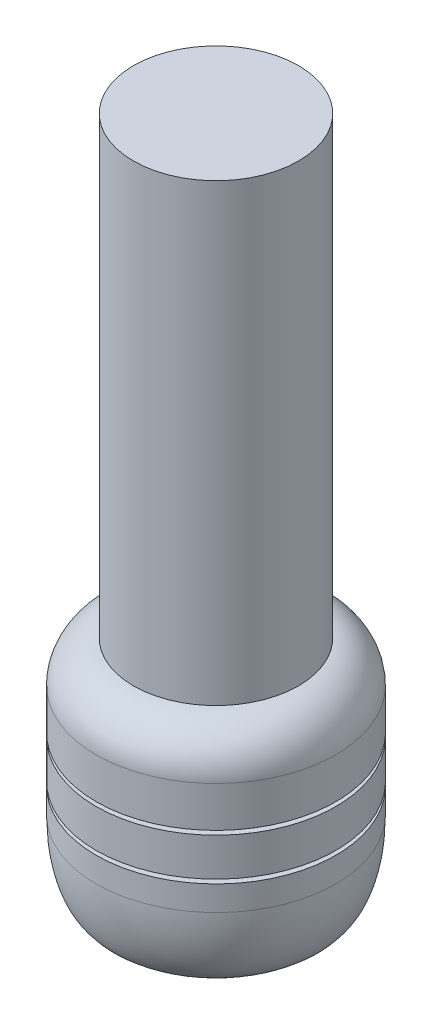
ISO-10303-21;
HEADER;
FILE_DESCRIPTION(('STEP AP214'),'2;1');
FILE_NAME('part.step','',(''),(''),'','','');
FILE_SCHEMA(('AUTOMOTIVE_DESIGN { 1 0 10303 214 1 1 1 1 }'));
ENDSEC;
DATA;
#1=APPLICATION_CONTEXT('core data for automotive mechanical design processes');
#2=APPLICATION_PROTOCOL_DEFINITION('international standard','automotive_design',2000,#1);
#3=PRODUCT_CONTEXT('',#1,'mechanical');
#4=PRODUCT('Part','Part','',(#3));
#5=PRODUCT_RELATED_PRODUCT_CATEGORY('part','',(#4));
#6=PRODUCT_DEFINITION_FORMATION('','',#4);
#7=PRODUCT_DEFINITION_CONTEXT('part definition',#1,'design');
#8=PRODUCT_DEFINITION('design','',#6,#7);
#9=PRODUCT_DEFINITION_SHAPE('','',#8);
#10=(LENGTH_UNIT() NAMED_UNIT(*) SI_UNIT(.MILLI.,.METRE.));
#11=(NAMED_UNIT(*) PLANE_ANGLE_UNIT() SI_UNIT($,.RADIAN.));
#12=(NAMED_UNIT(*) SI_UNIT($,.STERADIAN.) SOLID_ANGLE_UNIT());
#13=UNCERTAINTY_MEASURE_WITH_UNIT(LENGTH_MEASURE(1.E-05),#10,'distance_accuracy_value','');
#14=(GEOMETRIC_REPRESENTATION_CONTEXT(3) GLOBAL_UNCERTAINTY_ASSIGNED_CONTEXT((#13)) GLOBAL_UNIT_ASSIGNED_CONTEXT((#10,
#11,#12)) REPRESENTATION_CONTEXT('',''));
#15=CARTESIAN_POINT('',(0.,0.,0.));
#16=DIRECTION('',(0.,0.,1.));
#17=DIRECTION('',(1.,0.,0.));
#18=AXIS2_PLACEMENT_3D('',#15,#16,#17);
#19=CARTESIAN_POINT('',(0.,-55.,0.));
#20=DIRECTION('',(0.,1.,0.));
#21=DIRECTION('',(0.,0.,1.));
#22=AXIS2_PLACEMENT_3D('',#19,#20,#21);
#23=CYLINDRICAL_SURFACE('',#22,29.);
#24=CARTESIAN_POINT('',(0.,-30.,0.));
#25=DIRECTION('',(0.,1.,0.));
#26=DIRECTION('',(0.,0.,1.));
#27=AXIS2_PLACEMENT_3D('',#24,#25,#26);
#28=CIRCLE('',#27,29.);
#29=CARTESIAN_POINT('',(0.,-30.,29.));
#30=VERTEX_POINT('',#29);
#31=EDGE_CURVE('E142',#30,#30,#28,.T.);
#32=ORIENTED_EDGE('',*,*,#31,.T.);
#33=EDGE_LOOP('',(#32));
#34=FACE_BOUND('',#33,.T.);
#35=CARTESIAN_POINT('',(0.,-20.7835963252645,0.));
#36=DIRECTION('',(0.,1.,0.));
#37=DIRECTION('',(0.,0.,1.));
#38=AXIS2_PLACEMENT_3D('',#35,#36,#37);
#39=CIRCLE('',#38,29.);
#40=CARTESIAN_POINT('',(0.,-20.7835963252645,29.));
#41=VERTEX_POINT('',#40);
#42=EDGE_CURVE('E137',#41,#41,#39,.T.);
#43=ORIENTED_EDGE('',*,*,#42,.F.);
#44=EDGE_LOOP('',(#43));
#45=FACE_BOUND('',#44,.T.);
#46=ADVANCED_FACE('F44',(#34,#45),#23,.T.);
#47=CARTESIAN_POINT('',(0.,-20.7835963252645,0.));
#48=DIRECTION('',(0.,1.,0.));
#49=DIRECTION('',(0.,0.,1.));
#50=AXIS2_PLACEMENT_3D('',#47,#48,#49);
#51=PLANE('',#50);
#52=CARTESIAN_POINT('',(0.,-20.7835963252645,0.));
#53=DIRECTION('',(0.,1.,0.));
#54=DIRECTION('',(0.,0.,1.));
#55=AXIS2_PLACEMENT_3D('',#52,#53,#54);
#56=CIRCLE('',#55,26.5);
#57=CARTESIAN_POINT('',(0.,-20.7835963252645,26.5));
#58=VERTEX_POINT('',#57);
#59=EDGE_CURVE('E138',#58,#58,#56,.T.);
#60=ORIENTED_EDGE('',*,*,#59,.F.);
#61=EDGE_LOOP('',(#60));
#62=FACE_BOUND('',#61,.T.);
#63=ORIENTED_EDGE('',*,*,#42,.T.);
#64=EDGE_LOOP('',(#63));
#65=FACE_BOUND('',#64,.T.);
#66=ADVANCED_FACE('F186',(#62,#65),#51,.T.);
#67=CARTESIAN_POINT('',(0.,-19.7835963252645,0.));
#68=DIRECTION('',(0.,1.,0.));
#69=DIRECTION('',(0.,0.,1.));
#70=AXIS2_PLACEMENT_3D('',#67,#68,#69);
#71=PLANE('',#70);
#72=CARTESIAN_POINT('',(0.,-19.7835963252645,0.));
#73=DIRECTION('',(0.,1.,0.));
#74=DIRECTION('',(0.,0.,1.));
#75=AXIS2_PLACEMENT_3D('',#72,#73,#74);
#76=CIRCLE('',#75,26.5);
#77=CARTESIAN_POINT('',(0.,-19.7835963252645,26.5));
#78=VERTEX_POINT('',#77);
#79=EDGE_CURVE('E151',#78,#78,#76,.T.);
#80=ORIENTED_EDGE('',*,*,#79,.T.);
#81=EDGE_LOOP('',(#80));
#82=FACE_BOUND('',#81,.T.);
#83=CARTESIAN_POINT('',(0.,-19.7835963252645,0.));
#84=DIRECTION('',(0.,1.,0.));
#85=DIRECTION('',(0.,0.,1.));
#86=AXIS2_PLACEMENT_3D('',#83,#84,#85);
#87=CIRCLE('',#86,29.);
#88=CARTESIAN_POINT('',(0.,-19.7835963252645,29.));
#89=VERTEX_POINT('',#88);
#90=EDGE_CURVE('E128',#89,#89,#87,.T.);
#91=ORIENTED_EDGE('',*,*,#90,.F.);
#92=EDGE_LOOP('',(#91));
#93=FACE_BOUND('',#92,.T.);
#94=ADVANCED_FACE('F190',(#82,#93),#71,.F.);
#95=CARTESIAN_POINT('',(0.,-20.7835963252645,0.));
#96=DIRECTION('',(0.,1.,0.));
#97=DIRECTION('',(0.,0.,1.));
#98=AXIS2_PLACEMENT_3D('',#95,#96,#97);
#99=CYLINDRICAL_SURFACE('',#98,26.5);
#100=ORIENTED_EDGE('',*,*,#59,.T.);
#101=EDGE_LOOP('',(#100));
#102=FACE_BOUND('',#101,.T.);
#103=ORIENTED_EDGE('',*,*,#79,.F.);
#104=EDGE_LOOP('',(#103));
#105=FACE_BOUND('',#104,.T.);
#106=ADVANCED_FACE('F212',(#102,#105),#99,.T.);
#107=CARTESIAN_POINT('',(0.,110.,0.));
#108=DIRECTION('',(0.,1.,0.));
#109=DIRECTION('',(0.,0.,1.));
#110=AXIS2_PLACEMENT_3D('',#107,#108,#109);
#111=PLANE('',#110);
#112=CARTESIAN_POINT('',(0.,110.,0.));
#113=DIRECTION('',(0.,1.,0.));
#114=DIRECTION('',(0.,0.,1.));
#115=AXIS2_PLACEMENT_3D('',#112,#113,#114);
#116=CIRCLE('',#115,19.985);
#117=CARTESIAN_POINT('',(0.,110.,19.985));
#118=VERTEX_POINT('',#117);
#119=EDGE_CURVE('E69',#118,#118,#116,.T.);
#120=ORIENTED_EDGE('',*,*,#119,.T.);
#121=EDGE_LOOP('',(#120));
#122=FACE_BOUND('',#121,.T.);
#123=ADVANCED_FACE('F103',(#122),#111,.T.);
#124=CARTESIAN_POINT('',(0.,110.,0.));
#125=DIRECTION('',(0.,-1.,0.));
#126=DIRECTION('',(0.,0.,-1.));
#127=AXIS2_PLACEMENT_3D('',#124,#125,#126);
#128=CYLINDRICAL_SURFACE('',#127,19.985);
#129=ORIENTED_EDGE('',*,*,#119,.F.);
#130=EDGE_LOOP('',(#129));
#131=FACE_BOUND('',#130,.T.);
#132=CARTESIAN_POINT('',(0.,0.,0.));
#133=DIRECTION('',(0.,1.,0.));
#134=DIRECTION('',(0.,0.,1.));
#135=AXIS2_PLACEMENT_3D('',#132,#133,#134);
#136=CIRCLE('',#135,19.985);
#137=CARTESIAN_POINT('',(0.,0.,19.985));
#138=VERTEX_POINT('',#137);
#139=EDGE_CURVE('E75',#138,#138,#136,.T.);
#140=ORIENTED_EDGE('',*,*,#139,.T.);
#141=EDGE_LOOP('',(#140));
#142=FACE_BOUND('',#141,.T.);
#143=ADVANCED_FACE('F237',(#131,#142),#128,.T.);
#144=CARTESIAN_POINT('',(0.,-9.95137050862845,0.));
#145=DIRECTION('',(0.,1.,0.));
#146=DIRECTION('',(0.,0.,1.));
#147=AXIS2_PLACEMENT_3D('',#144,#145,#146);
#148=TOROIDAL_SURFACE('',#147,19.,10.);
#149=ORIENTED_EDGE('',*,*,#139,.F.);
#150=EDGE_LOOP('',(#149));
#151=FACE_BOUND('',#150,.T.);
#152=CARTESIAN_POINT('',(0.,-9.95137050862845,0.));
#153=DIRECTION('',(0.,1.,0.));
#154=DIRECTION('',(0.,0.,1.));
#155=AXIS2_PLACEMENT_3D('',#152,#153,#154);
#156=CIRCLE('',#155,29.);
#157=CARTESIAN_POINT('',(0.,-9.95137050862845,29.));
#158=VERTEX_POINT('',#157);
#159=EDGE_CURVE('E63',#158,#158,#156,.F.);
#160=ORIENTED_EDGE('',*,*,#159,.F.);
#161=EDGE_LOOP('',(#160));
#162=FACE_BOUND('',#161,.T.);
#163=ADVANCED_FACE('F100',(#151,#162),#148,.T.);
#164=ORIENTED_EDGE('',*,*,#90,.T.);
#165=EDGE_LOOP('',(#164));
#166=FACE_BOUND('',#165,.T.);
#167=ORIENTED_EDGE('',*,*,#159,.T.);
#168=EDGE_LOOP('',(#167));
#169=FACE_BOUND('',#168,.T.);
#170=ADVANCED_FACE('F95',(#166,#169),#23,.T.);
#171=CARTESIAN_POINT('',(0.,-31.,0.));
#172=DIRECTION('',(0.,1.,0.));
#173=DIRECTION('',(0.,0.,1.));
#174=AXIS2_PLACEMENT_3D('',#171,#172,#173);
#175=PLANE('',#174);
#176=CARTESIAN_POINT('',(0.,-31.,0.));
#177=DIRECTION('',(0.,1.,0.));
#178=DIRECTION('',(0.,0.,1.));
#179=AXIS2_PLACEMENT_3D('',#176,#177,#178);
#180=CIRCLE('',#179,26.5);
#181=CARTESIAN_POINT('',(0.,-31.,26.5));
#182=VERTEX_POINT('',#181);
#183=EDGE_CURVE('E145',#182,#182,#180,.T.);
#184=ORIENTED_EDGE('',*,*,#183,.F.);
#185=EDGE_LOOP('',(#184));
#186=FACE_BOUND('',#185,.T.);
#187=CARTESIAN_POINT('',(0.,-31.,0.));
#188=DIRECTION('',(0.,1.,0.));
#189=DIRECTION('',(0.,0.,1.));
#190=AXIS2_PLACEMENT_3D('',#187,#188,#189);
#191=CIRCLE('',#190,29.);
#192=CARTESIAN_POINT('',(0.,-31.,29.));
#193=VERTEX_POINT('',#192);
#194=EDGE_CURVE('E52',#193,#193,#191,.T.);
#195=ORIENTED_EDGE('',*,*,#194,.T.);
#196=EDGE_LOOP('',(#195));
#197=FACE_BOUND('',#196,.T.);
#198=ADVANCED_FACE('F99',(#186,#197),#175,.T.);
#199=CARTESIAN_POINT('',(0.,-30.,0.));
#200=DIRECTION('',(0.,1.,0.));
#201=DIRECTION('',(0.,0.,1.));
#202=AXIS2_PLACEMENT_3D('',#199,#200,#201);
#203=PLANE('',#202);
#204=CARTESIAN_POINT('',(0.,-30.,0.));
#205=DIRECTION('',(0.,1.,0.));
#206=DIRECTION('',(0.,0.,1.));
#207=AXIS2_PLACEMENT_3D('',#204,#205,#206);
#208=CIRCLE('',#207,26.5);
#209=CARTESIAN_POINT('',(0.,-30.,26.5));
#210=VERTEX_POINT('',#209);
#211=EDGE_CURVE('E153',#210,#210,#208,.T.);
#212=ORIENTED_EDGE('',*,*,#211,.T.);
#213=EDGE_LOOP('',(#212));
#214=FACE_BOUND('',#213,.T.);
#215=ORIENTED_EDGE('',*,*,#31,.F.);
#216=EDGE_LOOP('',(#215));
#217=FACE_BOUND('',#216,.T.);
#218=ADVANCED_FACE('F202',(#214,#217),#203,.F.);
#219=CARTESIAN_POINT('',(0.,-31.,0.));
#220=DIRECTION('',(0.,1.,0.));
#221=DIRECTION('',(0.,0.,1.));
#222=AXIS2_PLACEMENT_3D('',#219,#220,#221);
#223=CYLINDRICAL_SURFACE('',#222,26.5);
#224=ORIENTED_EDGE('',*,*,#183,.T.);
#225=EDGE_LOOP('',(#224));
#226=FACE_BOUND('',#225,.T.);
#227=ORIENTED_EDGE('',*,*,#211,.F.);
#228=EDGE_LOOP('',(#227));
#229=FACE_BOUND('',#228,.T.);
#230=ADVANCED_FACE('F182',(#226,#229),#223,.T.);
#231=CARTESIAN_POINT('',(0.,-20.,0.));
#232=DIRECTION('',(0.,-1.,0.));
#233=DIRECTION('',(0.,0.,-1.));
#234=AXIS2_PLACEMENT_3D('',#231,#232,#233);
#235=PLANE('',#234);
#236=CARTESIAN_POINT('',(0.,-20.,0.));
#237=DIRECTION('',(0.,-1.,0.));
#238=DIRECTION('',(0.,0.,-1.));
#239=AXIS2_PLACEMENT_3D('',#236,#237,#238);
#240=CIRCLE('',#239,15.);
#241=CARTESIAN_POINT('',(0.,-20.,-15.));
#242=VERTEX_POINT('',#241);
#243=EDGE_CURVE('E167',#242,#242,#240,.T.);
#244=ORIENTED_EDGE('',*,*,#243,.T.);
#245=EDGE_LOOP('',(#244));
#246=FACE_BOUND('',#245,.T.);
#247=ADVANCED_FACE('F177',(#246),#235,.T.);
#248=CARTESIAN_POINT('',(0.,-20.,0.));
#249=DIRECTION('',(0.,-1.,0.));
#250=DIRECTION('',(0.,0.,-1.));
#251=AXIS2_PLACEMENT_3D('',#248,#249,#250);
#252=CYLINDRICAL_SURFACE('',#251,15.);
#253=ORIENTED_EDGE('',*,*,#243,.F.);
#254=EDGE_LOOP('',(#253));
#255=FACE_BOUND('',#254,.T.);
#256=CARTESIAN_POINT('',(0.,-55.,0.));
#257=DIRECTION('',(0.,-1.,0.));
#258=DIRECTION('',(0.,0.,-1.));
#259=AXIS2_PLACEMENT_3D('',#256,#257,#258);
#260=CIRCLE('',#259,15.);
#261=CARTESIAN_POINT('',(0.,-55.,-15.));
#262=VERTEX_POINT('',#261);
#263=EDGE_CURVE('E141',#262,#262,#260,.T.);
#264=ORIENTED_EDGE('',*,*,#263,.T.);
#265=EDGE_LOOP('',(#264));
#266=FACE_BOUND('',#265,.T.);
#267=ADVANCED_FACE('F93',(#255,#266),#252,.F.);
#268=CARTESIAN_POINT('',(0.,-55.,0.));
#269=DIRECTION('',(0.,-1.,0.));
#270=DIRECTION('',(0.,0.,-1.));
#271=AXIS2_PLACEMENT_3D('',#268,#269,#270);
#272=PLANE('',#271);
#273=CARTESIAN_POINT('',(0.,-55.,-22.));
#274=CARTESIAN_POINT('',(-2.87979326481106,-55.,-22.));
#275=CARTESIAN_POINT('',(-5.75845345682233,-55.,-21.4273988863238));
#276=CARTESIAN_POINT('',(-11.0796175672417,-55.,-19.2233005441728));
#277=CARTESIAN_POINT('',(-13.5200278401519,-55.,-17.5926705320612));
#278=CARTESIAN_POINT('',(-17.5926705320563,-55.,-13.5200278401468));
#279=CARTESIAN_POINT('',(-19.2233005441678,-55.,-11.0796175672441));
#280=CARTESIAN_POINT('',(-21.4273988863288,-55.,-5.75845345681978));
#281=CARTESIAN_POINT('',(-22.,-55.,-2.87979326479902));
#282=CARTESIAN_POINT('',(-22.,-55.,2.87979326479895));
#283=CARTESIAN_POINT('',(-21.4273988863288,-55.,5.75845345682233));
#284=CARTESIAN_POINT('',(-19.2233005441678,-55.,11.0796175672417));
#285=CARTESIAN_POINT('',(-17.5926705320587,-55.,13.5200278401519));
#286=CARTESIAN_POINT('',(-13.5200278401494,-55.,17.5926705320562));
#287=CARTESIAN_POINT('',(-11.0796175672441,-55.,19.2233005441678));
#288=CARTESIAN_POINT('',(-5.75845345681978,-55.,21.4273988863288));
#289=CARTESIAN_POINT('',(-2.87979326479898,-55.,22.));
#290=CARTESIAN_POINT('',(2.87979326479898,-55.,22.));
#291=CARTESIAN_POINT('',(5.75845345681984,-55.,21.4273988863288));
#292=CARTESIAN_POINT('',(11.0796175672442,-55.,19.2233005441678));
#293=CARTESIAN_POINT('',(13.5200278401469,-55.,17.5926705320587));
#294=CARTESIAN_POINT('',(17.5926705320612,-55.,13.5200278401494));
#295=CARTESIAN_POINT('',(19.2233005441724,-55.,11.0796175672447));
#296=CARTESIAN_POINT('',(21.4273988863242,-55.,5.75845345681931));
#297=CARTESIAN_POINT('',(22.,-55.,2.87979326479898));
#298=CARTESIAN_POINT('',(22.,-55.,-2.87979326479898));
#299=CARTESIAN_POINT('',(21.4273988863242,-55.,-5.75845345681929));
#300=CARTESIAN_POINT('',(19.2233005441724,-55.,-11.0796175672446));
#301=CARTESIAN_POINT('',(17.5926705320562,-55.,-13.5200278401519));
#302=CARTESIAN_POINT('',(13.5200278401519,-55.,-17.5926705320562));
#303=CARTESIAN_POINT('',(11.0796175672431,-55.,-19.2233005441801));
#304=CARTESIAN_POINT('',(5.7584534568208,-55.,-21.4273988863165));
#305=CARTESIAN_POINT('',(2.87979326481106,-55.,-22.));
#306=CARTESIAN_POINT('',(0.,-55.,-22.));
#307=(BOUNDED_CURVE() B_SPLINE_CURVE(3,(#273,#274,#275,#276,#277,#278,#279,#280,#281,#282,#283,
#284,#285,#286,#287,#288,#289,#290,#291,#292,#293,#294,#295,#296,#297,#298,#299,#300,#301,#302,
#303,#304,#305,#306),.UNSPECIFIED.,.T.,.F.) B_SPLINE_CURVE_WITH_KNOTS((4,2,2,2,2,2,2,2,2,2,2,2,
2,2,2,2,4),(0.,0.392699081698725,0.785398163397448,1.17809724509617,1.5707963267949,
1.96349540849362,2.35619449019234,2.74889357189107,3.14159265358979,3.53429173528852,
3.92699081698724,4.31968989868597,4.71238898038469,5.10508806208341,5.49778714378214,
5.89048622548086,6.28318530717959),
.UNSPECIFIED.) CURVE() GEOMETRIC_REPRESENTATION_ITEM() RATIONAL_B_SPLINE_CURVE((1.,1.,1.,1.,1.,
1.,1.,1.,1.,1.,1.,1.,1.,1.,1.,1.,1.,1.,1.,1.,1.,1.,1.,1.,1.,1.,1.,1.,1.,1.,1.,1.,1.,1.)) REPRESENTATION_ITEM(''));
#308=CARTESIAN_POINT('',(0.,-55.,-22.));
#309=VERTEX_POINT('',#308);
#310=EDGE_CURVE('E57',#309,#309,#307,.F.);
#311=ORIENTED_EDGE('',*,*,#310,.T.);
#312=EDGE_LOOP('',(#311));
#313=FACE_BOUND('',#312,.T.);
#314=ORIENTED_EDGE('',*,*,#263,.F.);
#315=EDGE_LOOP('',(#314));
#316=FACE_BOUND('',#315,.T.);
#317=ADVANCED_FACE('F83',(#313,#316),#272,.T.);
#318=CARTESIAN_POINT('',(0.,-55.,-22.));
#319=CARTESIAN_POINT('',(2.87979326481106,-55.,-22.));
#320=CARTESIAN_POINT('',(5.7584534568208,-55.,-21.4273988863165));
#321=CARTESIAN_POINT('',(11.0796175672431,-55.,-19.2233005441801));
#322=CARTESIAN_POINT('',(13.5200278401519,-55.,-17.5926705320562));
#323=CARTESIAN_POINT('',(17.5926705320562,-55.,-13.5200278401519));
#324=CARTESIAN_POINT('',(19.2233005441724,-55.,-11.0796175672446));
#325=CARTESIAN_POINT('',(21.4273988863242,-55.,-5.75845345681929));
#326=CARTESIAN_POINT('',(22.,-55.,-2.87979326479898));
#327=CARTESIAN_POINT('',(22.,-55.,2.87979326479898));
#328=CARTESIAN_POINT('',(21.4273988863242,-55.,5.75845345681931));
#329=CARTESIAN_POINT('',(19.2233005441724,-55.,11.0796175672447));
#330=CARTESIAN_POINT('',(17.5926705320612,-55.,13.5200278401494));
#331=CARTESIAN_POINT('',(13.5200278401469,-55.,17.5926705320587));
#332=CARTESIAN_POINT('',(11.0796175672442,-55.,19.2233005441678));
#333=CARTESIAN_POINT('',(5.75845345681984,-55.,21.4273988863288));
#334=CARTESIAN_POINT('',(2.87979326479898,-55.,22.));
#335=CARTESIAN_POINT('',(-2.87979326479898,-55.,22.));
#336=CARTESIAN_POINT('',(-5.75845345681978,-55.,21.4273988863288));
#337=CARTESIAN_POINT('',(-11.0796175672441,-55.,19.2233005441678));
#338=CARTESIAN_POINT('',(-13.5200278401494,-55.,17.5926705320562));
#339=CARTESIAN_POINT('',(-17.5926705320587,-55.,13.5200278401519));
#340=CARTESIAN_POINT('',(-19.2233005441678,-55.,11.0796175672417));
#341=CARTESIAN_POINT('',(-21.4273988863288,-55.,5.75845345682233));
#342=CARTESIAN_POINT('',(-22.,-55.,2.87979326479895));
#343=CARTESIAN_POINT('',(-22.,-55.,-2.87979326479902));
#344=CARTESIAN_POINT('',(-21.4273988863288,-55.,-5.75845345681978));
#345=CARTESIAN_POINT('',(-19.2233005441678,-55.,-11.0796175672441));
#346=CARTESIAN_POINT('',(-17.5926705320563,-55.,-13.5200278401468));
#347=CARTESIAN_POINT('',(-13.5200278401519,-55.,-17.5926705320612));
#348=CARTESIAN_POINT('',(-11.0796175672417,-55.,-19.2233005441728));
#349=CARTESIAN_POINT('',(-5.75845345682233,-55.,-21.4273988863238));
#350=CARTESIAN_POINT('',(-2.87979326481106,-55.,-22.));
#351=CARTESIAN_POINT('',(0.,-55.,-22.));
#352=CARTESIAN_POINT('',(0.,-55.,-29.));
#353=CARTESIAN_POINT('',(3.79609112179639,-55.00000000001,-29.000000000005));
#354=CARTESIAN_POINT('',(7.59068864762651,-55.,-28.2452076228745));
#355=CARTESIAN_POINT('',(14.6049504295487,-55.,-25.3398052627802));
#356=CARTESIAN_POINT('',(17.8218548801991,-55.,-23.1903384286207));
#357=CARTESIAN_POINT('',(23.1903384286207,-55.,-17.8218548801991));
#358=CARTESIAN_POINT('',(25.3398052627716,-55.,-14.6049504295498));
#359=CARTESIAN_POINT('',(28.245207622883,-55.,-7.59068864762543));
#360=CARTESIAN_POINT('',(29.,-55.,-3.79609112178048));
#361=CARTESIAN_POINT('',(29.,-55.,3.79609112178047));
#362=CARTESIAN_POINT('',(28.245207622878,-55.,7.59068864762545));
#363=CARTESIAN_POINT('',(25.3398052627766,-55.,14.6049504295498));
#364=CARTESIAN_POINT('',(23.1903384286291,-55.,17.8218548802007));
#365=CARTESIAN_POINT('',(17.8218548801906,-55.,23.1903384286191));
#366=CARTESIAN_POINT('',(14.6049504295477,-55.,25.3398052627687));
#367=CARTESIAN_POINT('',(7.59068864762763,-55.,28.2452076228859));
#368=CARTESIAN_POINT('',(3.79609112178048,-55.,29.));
#369=CARTESIAN_POINT('',(-3.79609112178047,-55.,29.));
#370=CARTESIAN_POINT('',(-7.59068864762505,-55.,28.2452076228909));
#371=CARTESIAN_POINT('',(-14.6049504295501,-55.,25.3398052627638));
#372=CARTESIAN_POINT('',(-17.8218548802007,-55.,23.1903384286241));
#373=CARTESIAN_POINT('',(-23.1903384286191,-55.,17.8218548801956));
#374=CARTESIAN_POINT('',(-25.3398052627687,-55.,14.6049504295452));
#375=CARTESIAN_POINT('',(-28.2452076228859,-55.,7.59068864763012));
#376=CARTESIAN_POINT('',(-29.,-55.,3.79609112178043));
#377=CARTESIAN_POINT('',(-29.,-55.,-3.79609112178052));
#378=CARTESIAN_POINT('',(-28.2452076228859,-55.,-7.59068864762504));
#379=CARTESIAN_POINT('',(-25.3398052627688,-55.,-14.6049504295501));
#380=CARTESIAN_POINT('',(-23.1903384286192,-55.,-17.8218548801906));
#381=CARTESIAN_POINT('',(-17.8218548802007,-55.,-23.190338428629));
#382=CARTESIAN_POINT('',(-14.6049504295452,-55.,-25.3398052627737));
#383=CARTESIAN_POINT('',(-7.59068864763012,-55.,-28.2452076228809));
#384=CARTESIAN_POINT('',(-3.7960911217964,-54.99999999999,-28.999999999995));
#385=CARTESIAN_POINT('',(0.,-55.,-29.));
#386=CARTESIAN_POINT('',(0.,-37.,-29.));
#387=CARTESIAN_POINT('',(3.79609112179639,-37.,-29.));
#388=CARTESIAN_POINT('',(7.59068864762884,-37.,-28.2452076228801));
#389=CARTESIAN_POINT('',(14.6049504295464,-37.,-25.3398052627746));
#390=CARTESIAN_POINT('',(17.8218548801991,-37.,-23.1903384286207));
#391=CARTESIAN_POINT('',(23.1903384286207,-37.,-17.8218548801991));
#392=CARTESIAN_POINT('',(25.3398052627729,-37.,-14.6049504295503));
#393=CARTESIAN_POINT('',(28.2452076228817,-37.,-7.59068864762489));
#394=CARTESIAN_POINT('',(29.,-37.,-3.79609112178048));
#395=CARTESIAN_POINT('',(29.,-37.,3.79609112178047));
#396=CARTESIAN_POINT('',(28.245207622881,-37.,7.59068864762668));
#397=CARTESIAN_POINT('',(25.3398052627737,-37.,14.6049504295485));
#398=CARTESIAN_POINT('',(23.1903384286266,-37.,17.8218548801932));
#399=CARTESIAN_POINT('',(17.8218548801931,-37.,23.1903384286266));
#400=CARTESIAN_POINT('',(14.6049504295495,-37.,25.3398052627732));
#401=CARTESIAN_POINT('',(7.59068864762575,-37.,28.2452076228814));
#402=CARTESIAN_POINT('',(3.79609112178048,-37.,29.));
#403=CARTESIAN_POINT('',(-3.79609112178047,-37.,29.));
#404=CARTESIAN_POINT('',(-7.59068864762177,-37.,28.245207622883));
#405=CARTESIAN_POINT('',(-14.6049504295534,-37.,25.3398052627717));
#406=CARTESIAN_POINT('',(-17.8218548801957,-37.,23.1903384286241));
#407=CARTESIAN_POINT('',(-23.1903384286241,-37.,17.8218548801956));
#408=CARTESIAN_POINT('',(-25.3398052627741,-37.,14.6049504295474));
#409=CARTESIAN_POINT('',(-28.2452076228805,-37.,7.59068864762788));
#410=CARTESIAN_POINT('',(-29.,-37.,3.79609112178043));
#411=CARTESIAN_POINT('',(-29.,-37.,-3.79609112178052));
#412=CARTESIAN_POINT('',(-28.2452076228823,-37.,-7.59068864762353));
#413=CARTESIAN_POINT('',(-25.3398052627724,-37.,-14.6049504295516));
#414=CARTESIAN_POINT('',(-23.1903384286242,-37.,-17.8218548801956));
#415=CARTESIAN_POINT('',(-17.8218548801957,-37.,-23.1903384286241));
#416=CARTESIAN_POINT('',(-14.6049504295456,-37.,-25.3398052627749));
#417=CARTESIAN_POINT('',(-7.59068864762965,-37.,-28.2452076228797));
#418=CARTESIAN_POINT('',(-3.7960911217964,-37.,-29.));
#419=CARTESIAN_POINT('',(0.,-37.,-29.));
#420=(BOUNDED_SURFACE() B_SPLINE_SURFACE(2,3,((#318,#319,#320,#321,#322,#323,#324,#325,#326,
#327,#328,#329,#330,#331,#332,#333,#334,#335,#336,#337,#338,#339,#340,#341,#342,#343,#344,#345,
#346,#347,#348,#349,#350,#351),(#352,#353,#354,#355,#356,#357,#358,#359,#360,#361,#362,#363,
#364,#365,#366,#367,#368,#369,#370,#371,#372,#373,#374,#375,#376,#377,#378,#379,#380,#381,#382,
#383,#384,#385),(#386,#387,#388,#389,#390,#391,#392,#393,#394,#395,#396,#397,#398,#399,#400,
#401,#402,#403,#404,#405,#406,#407,#408,#409,#410,#411,#412,#413,#414,#415,#416,#417,#418,
#419)),.UNSPECIFIED.,.F.,.T.,.F.) B_SPLINE_SURFACE_WITH_KNOTS((3,3),(4,2,2,2,2,2,2,2,2,2,2,2,2,
2,2,2,4),(0.,1.),(0.,0.392699081698724,0.785398163397448,1.17809724509617,1.5707963267949,
1.96349540849362,2.35619449019234,2.74889357189107,3.14159265358979,3.53429173528852,
3.92699081698724,4.31968989868597,4.71238898038469,5.10508806208341,5.49778714378214,
5.89048622548086,6.28318530717959),
.UNSPECIFIED.) GEOMETRIC_REPRESENTATION_ITEM() RATIONAL_B_SPLINE_SURFACE(((1.,1.,1.,1.,1.,1.,1.,
1.,1.,1.,1.,1.,1.,1.,1.,1.,1.,1.,1.,1.,1.,1.,1.,1.,1.,1.,1.,1.,1.,1.,1.,1.,1.,1.),
(0.707106781186548,0.707106781186548,0.707106781186548,0.707106781186548,0.707106781186548,
0.707106781186548,0.707106781186548,0.707106781186548,0.707106781186548,0.707106781186548,
0.707106781186548,0.707106781186548,0.707106781186547,0.707106781186547,0.707106781186548,
0.707106781186548,0.707106781186548,0.707106781186548,0.707106781186548,0.707106781186548,
0.707106781186547,0.707106781186547,0.707106781186548,0.707106781186548,0.707106781186548,
0.707106781186548,0.707106781186548,0.707106781186548,0.707106781186548,0.707106781186548,
0.707106781186548,0.707106781186548,0.707106781186548,0.707106781186548),(1.,1.,1.,1.,1.,1.,1.,
1.,1.,1.,1.,1.,1.,1.,1.,1.,1.,1.,1.,1.,1.,1.,1.,1.,1.,1.,1.,1.,1.,1.,1.,1.,1.,1.))) REPRESENTATION_ITEM('') SURFACE());
#421=CARTESIAN_POINT('',(0.,-37.,-29.));
#422=CARTESIAN_POINT('',(3.79609112179639,-37.,-29.));
#423=CARTESIAN_POINT('',(7.59068864762884,-37.,-28.2452076228801));
#424=CARTESIAN_POINT('',(14.6049504295464,-37.,-25.3398052627746));
#425=CARTESIAN_POINT('',(17.8218548801991,-37.,-23.1903384286207));
#426=CARTESIAN_POINT('',(23.1903384286207,-37.,-17.8218548801991));
#427=CARTESIAN_POINT('',(25.3398052627729,-37.,-14.6049504295503));
#428=CARTESIAN_POINT('',(28.2452076228817,-37.,-7.59068864762489));
#429=CARTESIAN_POINT('',(29.,-37.,-3.79609112178048));
#430=CARTESIAN_POINT('',(29.,-37.,3.79609112178047));
#431=CARTESIAN_POINT('',(28.245207622881,-37.,7.59068864762668));
#432=CARTESIAN_POINT('',(25.3398052627737,-37.,14.6049504295485));
#433=CARTESIAN_POINT('',(23.1903384286266,-37.,17.8218548801932));
#434=CARTESIAN_POINT('',(17.8218548801931,-37.,23.1903384286266));
#435=CARTESIAN_POINT('',(14.6049504295495,-37.,25.3398052627732));
#436=CARTESIAN_POINT('',(7.59068864762575,-37.,28.2452076228814));
#437=CARTESIAN_POINT('',(3.79609112178048,-37.,29.));
#438=CARTESIAN_POINT('',(-3.79609112178047,-37.,29.));
#439=CARTESIAN_POINT('',(-7.59068864762177,-37.,28.245207622883));
#440=CARTESIAN_POINT('',(-14.6049504295534,-37.,25.3398052627717));
#441=CARTESIAN_POINT('',(-17.8218548801957,-37.,23.1903384286241));
#442=CARTESIAN_POINT('',(-23.1903384286241,-37.,17.8218548801956));
#443=CARTESIAN_POINT('',(-25.3398052627741,-37.,14.6049504295474));
#444=CARTESIAN_POINT('',(-28.2452076228805,-37.,7.59068864762788));
#445=CARTESIAN_POINT('',(-29.,-37.,3.79609112178043));
#446=CARTESIAN_POINT('',(-29.,-37.,-3.79609112178052));
#447=CARTESIAN_POINT('',(-28.2452076228823,-37.,-7.59068864762353));
#448=CARTESIAN_POINT('',(-25.3398052627724,-37.,-14.6049504295516));
#449=CARTESIAN_POINT('',(-23.1903384286242,-37.,-17.8218548801956));
#450=CARTESIAN_POINT('',(-17.8218548801957,-37.,-23.1903384286241));
#451=CARTESIAN_POINT('',(-14.6049504295456,-37.,-25.3398052627749));
#452=CARTESIAN_POINT('',(-7.59068864762965,-37.,-28.2452076228797));
#453=CARTESIAN_POINT('',(-3.7960911217964,-37.,-29.));
#454=CARTESIAN_POINT('',(0.,-37.,-29.));
#455=(BOUNDED_CURVE() B_SPLINE_CURVE(3,(#421,#422,#423,#424,#425,#426,#427,#428,#429,#430,#431,
#432,#433,#434,#435,#436,#437,#438,#439,#440,#441,#442,#443,#444,#445,#446,#447,#448,#449,#450,
#451,#452,#453,#454),.UNSPECIFIED.,.T.,.F.) B_SPLINE_CURVE_WITH_KNOTS((4,2,2,2,2,2,2,2,2,2,2,2,
2,2,2,2,4),(0.,0.392699081698724,0.785398163397448,1.17809724509617,1.5707963267949,
1.96349540849362,2.35619449019234,2.74889357189107,3.14159265358979,3.53429173528852,
3.92699081698724,4.31968989868597,4.71238898038469,5.10508806208341,5.49778714378214,
5.89048622548086,6.28318530717959),
.UNSPECIFIED.) CURVE() GEOMETRIC_REPRESENTATION_ITEM() RATIONAL_B_SPLINE_CURVE((1.,1.,1.,1.,1.,
1.,1.,1.,1.,1.,1.,1.,1.,1.,1.,1.,1.,1.,1.,1.,1.,1.,1.,1.,1.,1.,1.,1.,1.,1.,1.,1.,1.,1.)) REPRESENTATION_ITEM(''));
#456=CARTESIAN_POINT('',(0.,-37.,-29.));
#457=VERTEX_POINT('',#456);
#458=EDGE_CURVE('E11',#457,#457,#455,.F.);
#459=ORIENTED_EDGE('',*,*,#458,.F.);
#460=EDGE_LOOP('',(#459));
#461=FACE_BOUND('',#460,.T.);
#462=ORIENTED_EDGE('',*,*,#310,.F.);
#463=EDGE_LOOP('',(#462));
#464=FACE_BOUND('',#463,.T.);
#465=ADVANCED_FACE('F47',(#461,#464),#420,.T.);
#466=ORIENTED_EDGE('',*,*,#458,.T.);
#467=EDGE_LOOP('',(#466));
#468=FACE_BOUND('',#467,.T.);
#469=ORIENTED_EDGE('',*,*,#194,.F.);
#470=EDGE_LOOP('',(#469));
#471=FACE_BOUND('',#470,.T.);
#472=ADVANCED_FACE('F102',(#468,#471),#23,.T.);
#473=CLOSED_SHELL('',(#46,#66,#94,#106,#123,#143,#163,#170,#198,#218,#230,#247,#267,#317,#465,#472));
#474=MANIFOLD_SOLID_BREP('B2',#473);
#475=ADVANCED_BREP_SHAPE_REPRESENTATION('',(#18,#474),#14);
#476=SHAPE_DEFINITION_REPRESENTATION(#9,#475);
ENDSEC;
END-ISO-10303-21;
